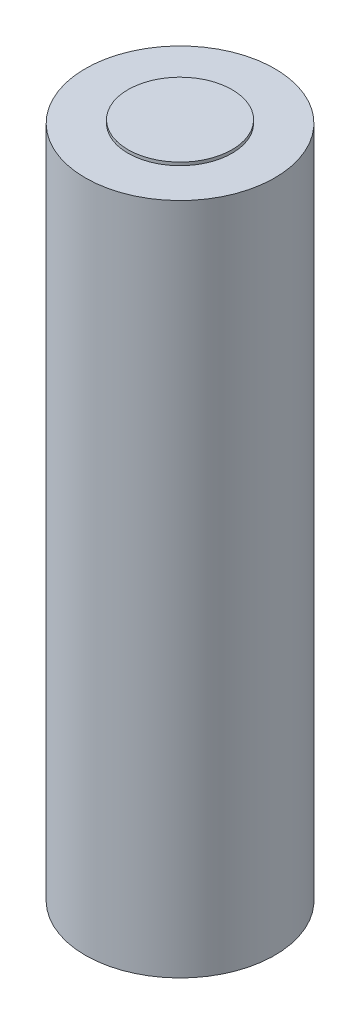
ISO-10303-21;
HEADER;
FILE_DESCRIPTION(('STEP AP214'),'2;1');
FILE_NAME('part.step','',(''),(''),'','','');
FILE_SCHEMA(('AUTOMOTIVE_DESIGN { 1 0 10303 214 1 1 1 1 }'));
ENDSEC;
DATA;
#1=APPLICATION_CONTEXT('core data for automotive mechanical design processes');
#2=APPLICATION_PROTOCOL_DEFINITION('international standard','automotive_design',2000,#1);
#3=PRODUCT_CONTEXT('',#1,'mechanical');
#4=PRODUCT('Part','Part','',(#3));
#5=PRODUCT_RELATED_PRODUCT_CATEGORY('part','',(#4));
#6=PRODUCT_DEFINITION_FORMATION('','',#4);
#7=PRODUCT_DEFINITION_CONTEXT('part definition',#1,'design');
#8=PRODUCT_DEFINITION('design','',#6,#7);
#9=PRODUCT_DEFINITION_SHAPE('','',#8);
#10=(LENGTH_UNIT() NAMED_UNIT(*) SI_UNIT(.MILLI.,.METRE.));
#11=(NAMED_UNIT(*) PLANE_ANGLE_UNIT() SI_UNIT($,.RADIAN.));
#12=(NAMED_UNIT(*) SI_UNIT($,.STERADIAN.) SOLID_ANGLE_UNIT());
#13=UNCERTAINTY_MEASURE_WITH_UNIT(LENGTH_MEASURE(1.E-05),#10,'distance_accuracy_value','');
#14=(GEOMETRIC_REPRESENTATION_CONTEXT(3) GLOBAL_UNCERTAINTY_ASSIGNED_CONTEXT((#13)) GLOBAL_UNIT_ASSIGNED_CONTEXT((#10,
#11,#12)) REPRESENTATION_CONTEXT('',''));
#15=CARTESIAN_POINT('',(0.,0.,0.));
#16=DIRECTION('',(0.,0.,1.));
#17=DIRECTION('',(1.,0.,0.));
#18=AXIS2_PLACEMENT_3D('',#15,#16,#17);
#19=CARTESIAN_POINT('',(0.,64.7,0.));
#20=DIRECTION('',(0.,1.,0.));
#21=DIRECTION('',(0.,0.,1.));
#22=AXIS2_PLACEMENT_3D('',#19,#20,#21);
#23=PLANE('',#22);
#24=CARTESIAN_POINT('',(0.,64.7,0.));
#25=DIRECTION('',(0.,1.,0.));
#26=DIRECTION('',(0.,0.,1.));
#27=AXIS2_PLACEMENT_3D('',#24,#25,#26);
#28=CIRCLE('',#27,9.1);
#29=CARTESIAN_POINT('',(0.,64.7,9.1));
#30=VERTEX_POINT('',#29);
#31=EDGE_CURVE('E10',#30,#30,#28,.T.);
#32=ORIENTED_EDGE('',*,*,#31,.T.);
#33=EDGE_LOOP('',(#32));
#34=FACE_BOUND('',#33,.T.);
#35=CARTESIAN_POINT('',(0.,64.7,0.));
#36=DIRECTION('',(0.,1.,0.));
#37=DIRECTION('',(0.,0.,1.));
#38=AXIS2_PLACEMENT_3D('',#35,#36,#37);
#39=CIRCLE('',#38,5.);
#40=CARTESIAN_POINT('',(0.,64.7,5.));
#41=VERTEX_POINT('',#40);
#42=EDGE_CURVE('E46',#41,#41,#39,.T.);
#43=ORIENTED_EDGE('',*,*,#42,.F.);
#44=EDGE_LOOP('',(#43));
#45=FACE_BOUND('',#44,.T.);
#46=ADVANCED_FACE('F33',(#34,#45),#23,.T.);
#47=CARTESIAN_POINT('',(0.,64.7,0.));
#48=DIRECTION('',(0.,-1.,0.));
#49=DIRECTION('',(0.,0.,-1.));
#50=AXIS2_PLACEMENT_3D('',#47,#48,#49);
#51=CYLINDRICAL_SURFACE('',#50,9.1);
#52=ORIENTED_EDGE('',*,*,#31,.F.);
#53=EDGE_LOOP('',(#52));
#54=FACE_BOUND('',#53,.T.);
#55=CARTESIAN_POINT('',(0.,0.,0.));
#56=DIRECTION('',(0.,1.,0.));
#57=DIRECTION('',(0.,0.,1.));
#58=AXIS2_PLACEMENT_3D('',#55,#56,#57);
#59=CIRCLE('',#58,9.1);
#60=CARTESIAN_POINT('',(0.,0.,9.1));
#61=VERTEX_POINT('',#60);
#62=EDGE_CURVE('E37',#61,#61,#59,.T.);
#63=ORIENTED_EDGE('',*,*,#62,.T.);
#64=EDGE_LOOP('',(#63));
#65=FACE_BOUND('',#64,.T.);
#66=ADVANCED_FACE('F35',(#54,#65),#51,.T.);
#67=CARTESIAN_POINT('',(0.,0.,0.));
#68=DIRECTION('',(0.,1.,0.));
#69=DIRECTION('',(0.,0.,1.));
#70=AXIS2_PLACEMENT_3D('',#67,#68,#69);
#71=PLANE('',#70);
#72=ORIENTED_EDGE('',*,*,#62,.F.);
#73=EDGE_LOOP('',(#72));
#74=FACE_BOUND('',#73,.T.);
#75=ADVANCED_FACE('F57',(#74),#71,.F.);
#76=CARTESIAN_POINT('',(0.,65.,0.));
#77=DIRECTION('',(0.,-1.,0.));
#78=DIRECTION('',(0.,0.,-1.));
#79=AXIS2_PLACEMENT_3D('',#76,#77,#78);
#80=CYLINDRICAL_SURFACE('',#79,5.);
#81=CARTESIAN_POINT('',(0.,65.,0.));
#82=DIRECTION('',(0.,1.,0.));
#83=DIRECTION('',(0.,0.,1.));
#84=AXIS2_PLACEMENT_3D('',#81,#82,#83);
#85=CIRCLE('',#84,5.);
#86=CARTESIAN_POINT('',(0.,65.,5.));
#87=VERTEX_POINT('',#86);
#88=EDGE_CURVE('E44',#87,#87,#85,.T.);
#89=ORIENTED_EDGE('',*,*,#88,.F.);
#90=EDGE_LOOP('',(#89));
#91=FACE_BOUND('',#90,.T.);
#92=ORIENTED_EDGE('',*,*,#42,.T.);
#93=EDGE_LOOP('',(#92));
#94=FACE_BOUND('',#93,.T.);
#95=ADVANCED_FACE('F54',(#91,#94),#80,.T.);
#96=CARTESIAN_POINT('',(0.,65.,0.));
#97=DIRECTION('',(0.,1.,0.));
#98=DIRECTION('',(0.,0.,1.));
#99=AXIS2_PLACEMENT_3D('',#96,#97,#98);
#100=PLANE('',#99);
#101=ORIENTED_EDGE('',*,*,#88,.T.);
#102=EDGE_LOOP('',(#101));
#103=FACE_BOUND('',#102,.T.);
#104=ADVANCED_FACE('F52',(#103),#100,.T.);
#105=CLOSED_SHELL('',(#46,#66,#75,#95,#104));
#106=MANIFOLD_SOLID_BREP('B2',#105);
#107=ADVANCED_BREP_SHAPE_REPRESENTATION('',(#18,#106),#14);
#108=SHAPE_DEFINITION_REPRESENTATION(#9,#107);
ENDSEC;
END-ISO-10303-21;
